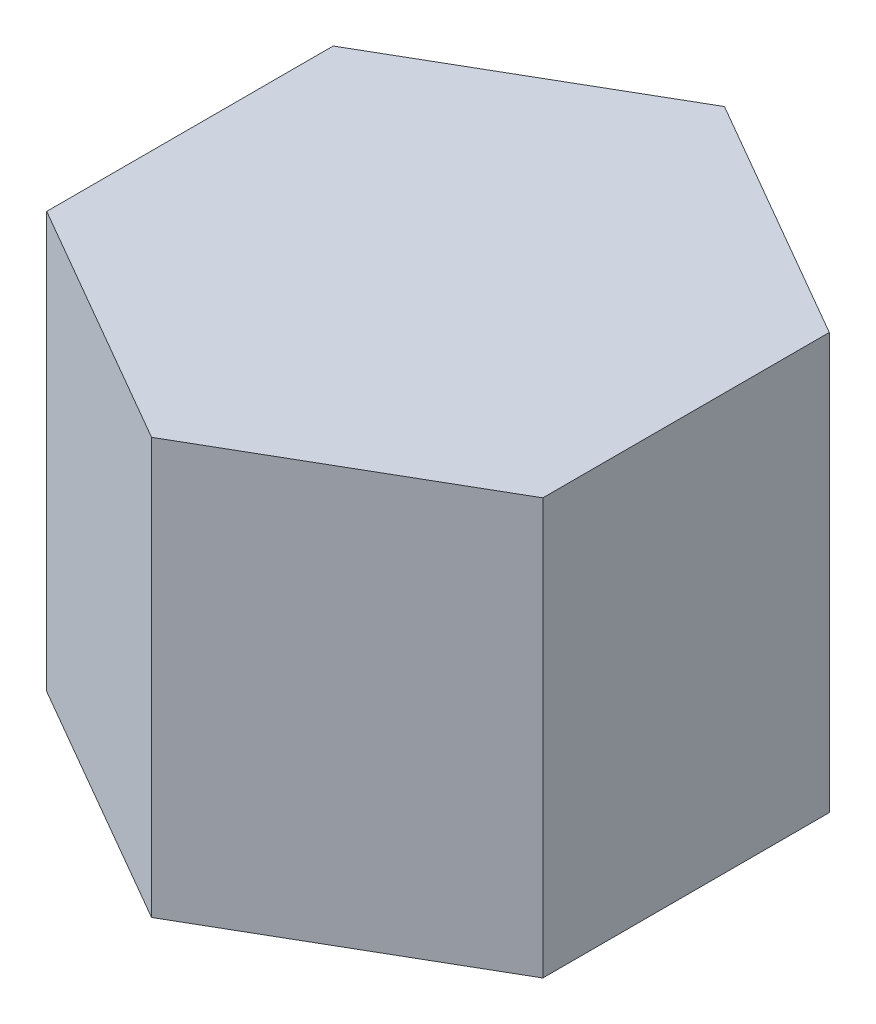
ISO-10303-21;
HEADER;
FILE_DESCRIPTION(('STEP AP214'),'2;1');
FILE_NAME('part.step','',(''),(''),'','','');
FILE_SCHEMA(('AUTOMOTIVE_DESIGN { 1 0 10303 214 1 1 1 1 }'));
ENDSEC;
DATA;
#1=APPLICATION_CONTEXT('core data for automotive mechanical design processes');
#2=APPLICATION_PROTOCOL_DEFINITION('international standard','automotive_design',2000,#1);
#3=PRODUCT_CONTEXT('',#1,'mechanical');
#4=PRODUCT('Part','Part','',(#3));
#5=PRODUCT_RELATED_PRODUCT_CATEGORY('part','',(#4));
#6=PRODUCT_DEFINITION_FORMATION('','',#4);
#7=PRODUCT_DEFINITION_CONTEXT('part definition',#1,'design');
#8=PRODUCT_DEFINITION('design','',#6,#7);
#9=PRODUCT_DEFINITION_SHAPE('','',#8);
#10=(LENGTH_UNIT() NAMED_UNIT(*) SI_UNIT(.MILLI.,.METRE.));
#11=(NAMED_UNIT(*) PLANE_ANGLE_UNIT() SI_UNIT($,.RADIAN.));
#12=(NAMED_UNIT(*) SI_UNIT($,.STERADIAN.) SOLID_ANGLE_UNIT());
#13=UNCERTAINTY_MEASURE_WITH_UNIT(LENGTH_MEASURE(1.E-05),#10,'distance_accuracy_value','');
#14=(GEOMETRIC_REPRESENTATION_CONTEXT(3) GLOBAL_UNCERTAINTY_ASSIGNED_CONTEXT((#13)) GLOBAL_UNIT_ASSIGNED_CONTEXT((#10,
#11,#12)) REPRESENTATION_CONTEXT('',''));
#15=CARTESIAN_POINT('',(0.,0.,0.));
#16=DIRECTION('',(0.,0.,1.));
#17=DIRECTION('',(1.,0.,0.));
#18=AXIS2_PLACEMENT_3D('',#15,#16,#17);
#19=CARTESIAN_POINT('',(210.142660308706,-148.537700895744,292.372996624279));
#20=DIRECTION('',(-0.499999999999909,0.,-0.866025403784491));
#21=DIRECTION('',(-0.866025403784491,0.,0.499999999999909));
#22=AXIS2_PLACEMENT_3D('',#19,#20,#21);
#23=PLANE('',#22);
#24=CARTESIAN_POINT('',(209.839551417382,-149.045793579175,292.547996624279));
#25=DIRECTION('',(0.866025403784491,0.,-0.499999999999909));
#26=VECTOR('',#25,1.);
#27=LINE('',#24,#26);
#28=CARTESIAN_POINT('',(209.839551417382,-149.045793579175,292.547996624279));
#29=VERTEX_POINT('',#28);
#30=CARTESIAN_POINT('',(210.142660308706,-149.045793579175,292.372996624279));
#31=VERTEX_POINT('',#30);
#32=EDGE_CURVE('E170',#29,#31,#27,.T.);
#33=ORIENTED_EDGE('',*,*,#32,.T.);
#34=CARTESIAN_POINT('',(210.142660308706,-148.537700895744,292.372996624279));
#35=DIRECTION('',(0.,-1.,0.));
#36=VECTOR('',#35,1.);
#37=LINE('',#34,#36);
#38=CARTESIAN_POINT('',(210.142660308706,-148.537700895744,292.372996624279));
#39=VERTEX_POINT('',#38);
#40=EDGE_CURVE('E35',#39,#31,#37,.T.);
#41=ORIENTED_EDGE('',*,*,#40,.F.);
#42=CARTESIAN_POINT('',(209.839551417382,-148.537700895744,292.547996624279));
#43=DIRECTION('',(0.866025403784491,0.,-0.499999999999909));
#44=VECTOR('',#43,1.);
#45=LINE('',#42,#44);
#46=CARTESIAN_POINT('',(209.839551417382,-148.537700895744,292.547996624279));
#47=VERTEX_POINT('',#46);
#48=EDGE_CURVE('E159',#47,#39,#45,.T.);
#49=ORIENTED_EDGE('',*,*,#48,.F.);
#50=CARTESIAN_POINT('',(209.839551417382,-148.537700895744,292.547996624279));
#51=DIRECTION('',(0.,-1.,0.));
#52=VECTOR('',#51,1.);
#53=LINE('',#50,#52);
#54=EDGE_CURVE('E10',#47,#29,#53,.T.);
#55=ORIENTED_EDGE('',*,*,#54,.T.);
#56=EDGE_LOOP('',(#33,#41,#49,#55));
#57=FACE_BOUND('',#56,.T.);
#58=ADVANCED_FACE('F16',(#57),#23,.F.);
#59=CARTESIAN_POINT('',(209.839551417382,-148.537700895744,292.547996624279));
#60=DIRECTION('',(0.500000000000096,0.,-0.866025403784383));
#61=DIRECTION('',(-0.866025403784383,0.,-0.500000000000096));
#62=AXIS2_PLACEMENT_3D('',#59,#60,#61);
#63=PLANE('',#62);
#64=CARTESIAN_POINT('',(209.536442526057,-149.045793579175,292.372996624279));
#65=DIRECTION('',(0.866025403784383,0.,0.500000000000096));
#66=VECTOR('',#65,1.);
#67=LINE('',#64,#66);
#68=CARTESIAN_POINT('',(209.536442526057,-149.045793579175,292.372996624279));
#69=VERTEX_POINT('',#68);
#70=EDGE_CURVE('E167',#69,#29,#67,.T.);
#71=ORIENTED_EDGE('',*,*,#70,.T.);
#72=ORIENTED_EDGE('',*,*,#54,.F.);
#73=CARTESIAN_POINT('',(209.536442526057,-148.537700895744,292.372996624279));
#74=DIRECTION('',(0.866025403784383,0.,0.500000000000096));
#75=VECTOR('',#74,1.);
#76=LINE('',#73,#75);
#77=CARTESIAN_POINT('',(209.536442526057,-148.537700895744,292.372996624279));
#78=VERTEX_POINT('',#77);
#79=EDGE_CURVE('E156',#78,#47,#76,.T.);
#80=ORIENTED_EDGE('',*,*,#79,.F.);
#81=CARTESIAN_POINT('',(209.536442526057,-148.537700895744,292.372996624279));
#82=DIRECTION('',(0.,-1.,0.));
#83=VECTOR('',#82,1.);
#84=LINE('',#81,#83);
#85=EDGE_CURVE('E27',#78,#69,#84,.T.);
#86=ORIENTED_EDGE('',*,*,#85,.T.);
#87=EDGE_LOOP('',(#71,#72,#80,#86));
#88=FACE_BOUND('',#87,.T.);
#89=ADVANCED_FACE('F189',(#88),#63,.F.);
#90=CARTESIAN_POINT('',(209.536442526057,-148.537700895744,290.831971220494));
#91=DIRECTION('',(1.,0.,0.));
#92=DIRECTION('',(0.,1.,0.));
#93=AXIS2_PLACEMENT_3D('',#90,#91,#92);
#94=PLANE('',#93);
#95=CARTESIAN_POINT('',(209.536442526057,-149.045793579175,292.022996624279));
#96=DIRECTION('',(0.,0.,1.));
#97=VECTOR('',#96,1.);
#98=LINE('',#95,#97);
#99=CARTESIAN_POINT('',(209.536442526057,-149.045793579175,292.022996624279));
#100=VERTEX_POINT('',#99);
#101=EDGE_CURVE('E163',#100,#69,#98,.T.);
#102=ORIENTED_EDGE('',*,*,#101,.T.);
#103=ORIENTED_EDGE('',*,*,#85,.F.);
#104=CARTESIAN_POINT('',(209.536442526057,-148.537700895744,292.022996624279));
#105=DIRECTION('',(0.,0.,1.));
#106=VECTOR('',#105,1.);
#107=LINE('',#104,#106);
#108=CARTESIAN_POINT('',(209.536442526057,-148.537700895744,292.022996624279));
#109=VERTEX_POINT('',#108);
#110=EDGE_CURVE('E106',#109,#78,#107,.T.);
#111=ORIENTED_EDGE('',*,*,#110,.F.);
#112=CARTESIAN_POINT('',(209.536442526057,-148.537700895744,292.022996624279));
#113=DIRECTION('',(0.,-1.,0.));
#114=VECTOR('',#113,1.);
#115=LINE('',#112,#114);
#116=EDGE_CURVE('E94',#109,#100,#115,.T.);
#117=ORIENTED_EDGE('',*,*,#116,.T.);
#118=EDGE_LOOP('',(#102,#103,#111,#117));
#119=FACE_BOUND('',#118,.T.);
#120=ADVANCED_FACE('F198',(#119),#94,.F.);
#121=CARTESIAN_POINT('',(209.536442526057,-148.537700895744,292.022996624279));
#122=DIRECTION('',(0.499999999999943,0.,0.866025403784472));
#123=DIRECTION('',(0.866025403784472,0.,-0.499999999999943));
#124=AXIS2_PLACEMENT_3D('',#121,#122,#123);
#125=PLANE('',#124);
#126=CARTESIAN_POINT('',(209.839551417382,-149.045793579175,291.847996624279));
#127=DIRECTION('',(-0.866025403784471,0.,0.499999999999943));
#128=VECTOR('',#127,1.);
#129=LINE('',#126,#128);
#130=CARTESIAN_POINT('',(209.839551417382,-149.045793579175,291.847996624279));
#131=VERTEX_POINT('',#130);
#132=EDGE_CURVE('E162',#131,#100,#129,.T.);
#133=ORIENTED_EDGE('',*,*,#132,.T.);
#134=ORIENTED_EDGE('',*,*,#116,.F.);
#135=CARTESIAN_POINT('',(209.839551417382,-148.537700895744,291.847996624279));
#136=DIRECTION('',(-0.866025403784471,0.,0.499999999999943));
#137=VECTOR('',#136,1.);
#138=LINE('',#135,#137);
#139=CARTESIAN_POINT('',(209.839551417382,-148.537700895744,291.847996624279));
#140=VERTEX_POINT('',#139);
#141=EDGE_CURVE('E98',#140,#109,#138,.T.);
#142=ORIENTED_EDGE('',*,*,#141,.F.);
#143=CARTESIAN_POINT('',(209.839551417382,-148.537700895744,291.847996624279));
#144=DIRECTION('',(0.,-1.,0.));
#145=VECTOR('',#144,1.);
#146=LINE('',#143,#145);
#147=EDGE_CURVE('E79',#140,#131,#146,.T.);
#148=ORIENTED_EDGE('',*,*,#147,.T.);
#149=EDGE_LOOP('',(#133,#134,#142,#148));
#150=FACE_BOUND('',#149,.T.);
#151=ADVANCED_FACE('F100',(#150),#125,.F.);
#152=CARTESIAN_POINT('',(209.839551417382,-148.537700895744,291.847996624279));
#153=DIRECTION('',(-0.500000000000062,0.,0.866025403784403));
#154=DIRECTION('',(0.866025403784403,0.,0.500000000000062));
#155=AXIS2_PLACEMENT_3D('',#152,#153,#154);
#156=PLANE('',#155);
#157=CARTESIAN_POINT('',(210.142660308706,-149.045793579175,292.022996624279));
#158=DIRECTION('',(-0.866025403784403,0.,-0.500000000000062));
#159=VECTOR('',#158,1.);
#160=LINE('',#157,#159);
#161=CARTESIAN_POINT('',(210.142660308706,-149.045793579175,292.022996624279));
#162=VERTEX_POINT('',#161);
#163=EDGE_CURVE('E88',#162,#131,#160,.T.);
#164=ORIENTED_EDGE('',*,*,#163,.T.);
#165=ORIENTED_EDGE('',*,*,#147,.F.);
#166=CARTESIAN_POINT('',(210.142660308706,-148.537700895744,292.022996624279));
#167=DIRECTION('',(-0.866025403784403,0.,-0.500000000000062));
#168=VECTOR('',#167,1.);
#169=LINE('',#166,#168);
#170=CARTESIAN_POINT('',(210.142660308706,-148.537700895744,292.022996624279));
#171=VERTEX_POINT('',#170);
#172=EDGE_CURVE('E84',#171,#140,#169,.T.);
#173=ORIENTED_EDGE('',*,*,#172,.F.);
#174=CARTESIAN_POINT('',(210.142660308706,-148.537700895744,292.022996624279));
#175=DIRECTION('',(0.,-1.,0.));
#176=VECTOR('',#175,1.);
#177=LINE('',#174,#176);
#178=EDGE_CURVE('E58',#171,#162,#177,.T.);
#179=ORIENTED_EDGE('',*,*,#178,.T.);
#180=EDGE_LOOP('',(#164,#165,#173,#179));
#181=FACE_BOUND('',#180,.T.);
#182=ADVANCED_FACE('F82',(#181),#156,.F.);
#183=CARTESIAN_POINT('',(210.142660308706,-148.537700895744,290.831971220494));
#184=DIRECTION('',(-1.,0.,0.));
#185=DIRECTION('',(0.,-1.,0.));
#186=AXIS2_PLACEMENT_3D('',#183,#184,#185);
#187=PLANE('',#186);
#188=CARTESIAN_POINT('',(210.142660308706,-149.045793579175,292.372996624279));
#189=DIRECTION('',(0.,0.,-1.));
#190=VECTOR('',#189,1.);
#191=LINE('',#188,#190);
#192=EDGE_CURVE('E160',#31,#162,#191,.T.);
#193=ORIENTED_EDGE('',*,*,#192,.T.);
#194=ORIENTED_EDGE('',*,*,#178,.F.);
#195=CARTESIAN_POINT('',(210.142660308706,-148.537700895744,292.372996624279));
#196=DIRECTION('',(0.,0.,-1.));
#197=VECTOR('',#196,1.);
#198=LINE('',#195,#197);
#199=EDGE_CURVE('E112',#39,#171,#198,.T.);
#200=ORIENTED_EDGE('',*,*,#199,.F.);
#201=ORIENTED_EDGE('',*,*,#40,.T.);
#202=EDGE_LOOP('',(#193,#194,#200,#201));
#203=FACE_BOUND('',#202,.T.);
#204=ADVANCED_FACE('F131',(#203),#187,.F.);
#205=CARTESIAN_POINT('',(206.339551417382,-148.537700895744,290.831971220494));
#206=DIRECTION('',(0.,-1.,0.));
#207=DIRECTION('',(1.,0.,0.));
#208=AXIS2_PLACEMENT_3D('',#205,#206,#207);
#209=PLANE('',#208);
#210=ORIENTED_EDGE('',*,*,#48,.T.);
#211=ORIENTED_EDGE('',*,*,#199,.T.);
#212=ORIENTED_EDGE('',*,*,#172,.T.);
#213=ORIENTED_EDGE('',*,*,#141,.T.);
#214=ORIENTED_EDGE('',*,*,#110,.T.);
#215=ORIENTED_EDGE('',*,*,#79,.T.);
#216=EDGE_LOOP('',(#210,#211,#212,#213,#214,#215));
#217=FACE_BOUND('',#216,.T.);
#218=ADVANCED_FACE('F111',(#217),#209,.F.);
#219=CARTESIAN_POINT('',(206.339551417382,-149.045793579175,290.831971220494));
#220=DIRECTION('',(0.,-1.,0.));
#221=DIRECTION('',(1.,0.,0.));
#222=AXIS2_PLACEMENT_3D('',#219,#220,#221);
#223=PLANE('',#222);
#224=ORIENTED_EDGE('',*,*,#32,.F.);
#225=ORIENTED_EDGE('',*,*,#70,.F.);
#226=ORIENTED_EDGE('',*,*,#101,.F.);
#227=ORIENTED_EDGE('',*,*,#132,.F.);
#228=ORIENTED_EDGE('',*,*,#163,.F.);
#229=ORIENTED_EDGE('',*,*,#192,.F.);
#230=EDGE_LOOP('',(#224,#225,#226,#227,#228,#229));
#231=FACE_BOUND('',#230,.T.);
#232=ADVANCED_FACE('F130',(#231),#223,.T.);
#233=CLOSED_SHELL('',(#58,#89,#120,#151,#182,#204,#218,#232));
#234=MANIFOLD_SOLID_BREP('B1',#233);
#235=ADVANCED_BREP_SHAPE_REPRESENTATION('',(#18,#234),#14);
#236=SHAPE_DEFINITION_REPRESENTATION(#9,#235);
ENDSEC;
END-ISO-10303-21;
